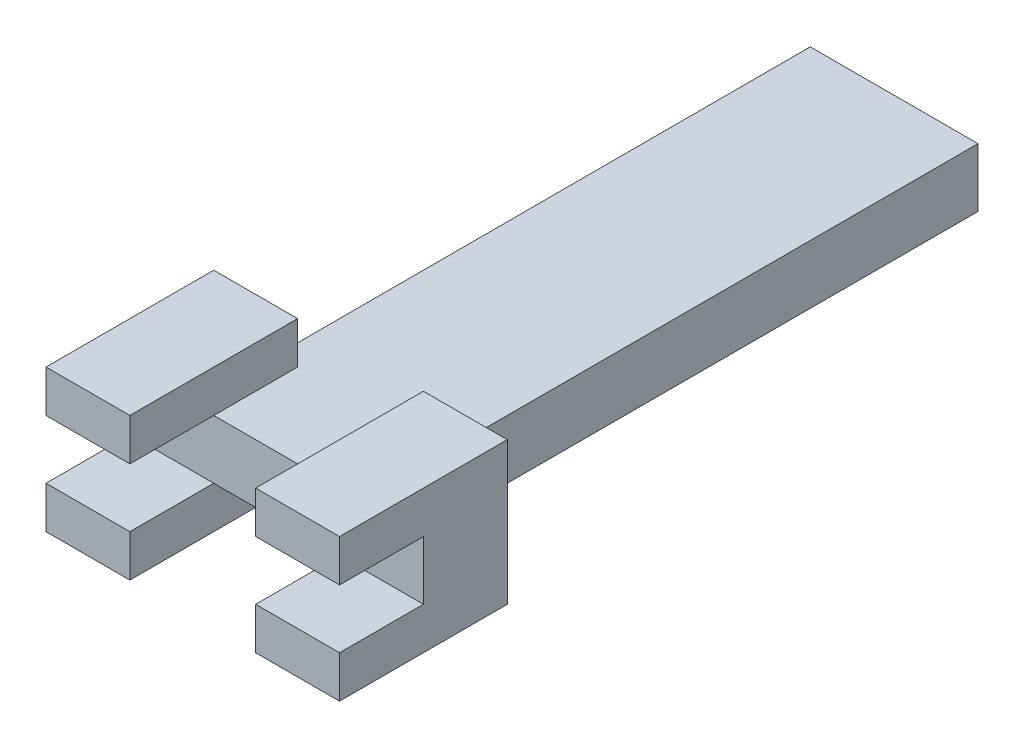
ISO-10303-21;
HEADER;
FILE_DESCRIPTION(('STEP AP214'),'2;1');
FILE_NAME('part.step','',(''),(''),'','','');
FILE_SCHEMA(('AUTOMOTIVE_DESIGN { 1 0 10303 214 1 1 1 1 }'));
ENDSEC;
DATA;
#1=APPLICATION_CONTEXT('core data for automotive mechanical design processes');
#2=APPLICATION_PROTOCOL_DEFINITION('international standard','automotive_design',2000,#1);
#3=PRODUCT_CONTEXT('',#1,'mechanical');
#4=PRODUCT('Part','Part','',(#3));
#5=PRODUCT_RELATED_PRODUCT_CATEGORY('part','',(#4));
#6=PRODUCT_DEFINITION_FORMATION('','',#4);
#7=PRODUCT_DEFINITION_CONTEXT('part definition',#1,'design');
#8=PRODUCT_DEFINITION('design','',#6,#7);
#9=PRODUCT_DEFINITION_SHAPE('','',#8);
#10=(LENGTH_UNIT() NAMED_UNIT(*) SI_UNIT(.MILLI.,.METRE.));
#11=(NAMED_UNIT(*) PLANE_ANGLE_UNIT() SI_UNIT($,.RADIAN.));
#12=(NAMED_UNIT(*) SI_UNIT($,.STERADIAN.) SOLID_ANGLE_UNIT());
#13=UNCERTAINTY_MEASURE_WITH_UNIT(LENGTH_MEASURE(1.E-05),#10,'distance_accuracy_value','');
#14=(GEOMETRIC_REPRESENTATION_CONTEXT(3) GLOBAL_UNCERTAINTY_ASSIGNED_CONTEXT((#13)) GLOBAL_UNIT_ASSIGNED_CONTEXT((#10,
#11,#12)) REPRESENTATION_CONTEXT('',''));
#15=CARTESIAN_POINT('',(0.,0.,0.));
#16=DIRECTION('',(0.,0.,1.));
#17=DIRECTION('',(1.,0.,0.));
#18=AXIS2_PLACEMENT_3D('',#15,#16,#17);
#19=CARTESIAN_POINT('',(0.,0.,0.));
#20=DIRECTION('',(0.,-1.,0.));
#21=DIRECTION('',(0.,0.,-1.));
#22=AXIS2_PLACEMENT_3D('',#19,#20,#21);
#23=PLANE('',#22);
#24=DIRECTION('',(0.,0.,1.));
#25=VECTOR('',#24,1.);
#26=CARTESIAN_POINT('',(17.5,0.,0.));
#27=LINE('',#26,#25);
#28=CARTESIAN_POINT('',(17.5,0.,-10.));
#29=VERTEX_POINT('',#28);
#30=CARTESIAN_POINT('',(17.5,0.,0.));
#31=VERTEX_POINT('',#30);
#32=EDGE_CURVE('E429',#29,#31,#27,.T.);
#33=ORIENTED_EDGE('',*,*,#32,.T.);
#34=DIRECTION('',(1.,0.,0.));
#35=VECTOR('',#34,1.);
#36=CARTESIAN_POINT('',(0.,0.,0.));
#37=LINE('',#36,#35);
#38=CARTESIAN_POINT('',(2.5,0.,0.));
#39=VERTEX_POINT('',#38);
#40=EDGE_CURVE('E356',#39,#31,#37,.T.);
#41=ORIENTED_EDGE('',*,*,#40,.F.);
#42=DIRECTION('',(0.,0.,-1.));
#43=VECTOR('',#42,1.);
#44=CARTESIAN_POINT('',(2.5,0.,0.));
#45=LINE('',#44,#43);
#46=CARTESIAN_POINT('',(2.5,0.,-10.));
#47=VERTEX_POINT('',#46);
#48=EDGE_CURVE('E219',#39,#47,#45,.T.);
#49=ORIENTED_EDGE('',*,*,#48,.T.);
#50=DIRECTION('',(-1.,0.,0.));
#51=VECTOR('',#50,1.);
#52=CARTESIAN_POINT('',(2.5,0.,-10.));
#53=LINE('',#52,#51);
#54=CARTESIAN_POINT('',(0.,0.,-10.));
#55=VERTEX_POINT('',#54);
#56=EDGE_CURVE('E64',#47,#55,#53,.T.);
#57=ORIENTED_EDGE('',*,*,#56,.T.);
#58=DIRECTION('',(0.,0.,1.));
#59=VECTOR('',#58,1.);
#60=CARTESIAN_POINT('',(0.,0.,0.));
#61=LINE('',#60,#59);
#62=CARTESIAN_POINT('',(0.,0.,-73.6254664348473));
#63=VERTEX_POINT('',#62);
#64=EDGE_CURVE('E336',#63,#55,#61,.T.);
#65=ORIENTED_EDGE('',*,*,#64,.F.);
#66=DIRECTION('',(-1.,0.,0.));
#67=VECTOR('',#66,1.);
#68=CARTESIAN_POINT('',(0.,0.,-73.6254664348473));
#69=LINE('',#68,#67);
#70=CARTESIAN_POINT('',(20.,0.,-73.6254664348473));
#71=VERTEX_POINT('',#70);
#72=EDGE_CURVE('E342',#71,#63,#69,.T.);
#73=ORIENTED_EDGE('',*,*,#72,.F.);
#74=DIRECTION('',(0.,0.,-1.));
#75=VECTOR('',#74,1.);
#76=CARTESIAN_POINT('',(20.,0.,0.));
#77=LINE('',#76,#75);
#78=CARTESIAN_POINT('',(20.,0.,-10.));
#79=VERTEX_POINT('',#78);
#80=EDGE_CURVE('E359',#79,#71,#77,.T.);
#81=ORIENTED_EDGE('',*,*,#80,.F.);
#82=DIRECTION('',(-1.,0.,0.));
#83=VECTOR('',#82,1.);
#84=CARTESIAN_POINT('',(17.5,0.,-10.));
#85=LINE('',#84,#83);
#86=EDGE_CURVE('E445',#79,#29,#85,.T.);
#87=ORIENTED_EDGE('',*,*,#86,.T.);
#88=EDGE_LOOP('',(#33,#41,#49,#57,#65,#73,#81,#87));
#89=FACE_BOUND('',#88,.T.);
#90=ADVANCED_FACE('F39',(#89),#23,.T.);
#91=CARTESIAN_POINT('',(20.,7.,0.));
#92=DIRECTION('',(-1.,0.,0.));
#93=DIRECTION('',(0.,0.,1.));
#94=AXIS2_PLACEMENT_3D('',#91,#92,#93);
#95=PLANE('',#94);
#96=DIRECTION('',(0.,1.,0.));
#97=VECTOR('',#96,1.);
#98=CARTESIAN_POINT('',(20.,3.5,-10.));
#99=LINE('',#98,#97);
#100=CARTESIAN_POINT('',(20.,7.,-10.));
#101=VERTEX_POINT('',#100);
#102=EDGE_CURVE('E236',#79,#101,#99,.T.);
#103=ORIENTED_EDGE('',*,*,#102,.F.);
#104=ORIENTED_EDGE('',*,*,#80,.T.);
#105=DIRECTION('',(0.,-1.,0.));
#106=VECTOR('',#105,1.);
#107=CARTESIAN_POINT('',(20.,7.,-73.6254664348473));
#108=LINE('',#107,#106);
#109=CARTESIAN_POINT('',(20.,7.,-73.6254664348473));
#110=VERTEX_POINT('',#109);
#111=EDGE_CURVE('E43',#110,#71,#108,.T.);
#112=ORIENTED_EDGE('',*,*,#111,.F.);
#113=DIRECTION('',(0.,0.,-1.));
#114=VECTOR('',#113,1.);
#115=CARTESIAN_POINT('',(20.,7.,0.));
#116=LINE('',#115,#114);
#117=EDGE_CURVE('E346',#101,#110,#116,.T.);
#118=ORIENTED_EDGE('',*,*,#117,.F.);
#119=EDGE_LOOP('',(#103,#104,#112,#118));
#120=FACE_BOUND('',#119,.T.);
#121=ADVANCED_FACE('F516',(#120),#95,.F.);
#122=CARTESIAN_POINT('',(0.,7.,0.));
#123=DIRECTION('',(0.,-1.,0.));
#124=DIRECTION('',(0.,0.,-1.));
#125=AXIS2_PLACEMENT_3D('',#122,#123,#124);
#126=PLANE('',#125);
#127=DIRECTION('',(1.,0.,0.));
#128=VECTOR('',#127,1.);
#129=CARTESIAN_POINT('',(17.5,7.,0.));
#130=LINE('',#129,#128);
#131=CARTESIAN_POINT('',(17.5,7.,0.));
#132=VERTEX_POINT('',#131);
#133=CARTESIAN_POINT('',(27.5,7.,0.));
#134=VERTEX_POINT('',#133);
#135=EDGE_CURVE('E200',#132,#134,#130,.T.);
#136=ORIENTED_EDGE('',*,*,#135,.T.);
#137=DIRECTION('',(0.,0.,-1.));
#138=VECTOR('',#137,1.);
#139=CARTESIAN_POINT('',(27.5,7.,0.));
#140=LINE('',#139,#138);
#141=CARTESIAN_POINT('',(27.5,7.,10.));
#142=VERTEX_POINT('',#141);
#143=EDGE_CURVE('E296',#142,#134,#140,.T.);
#144=ORIENTED_EDGE('',*,*,#143,.F.);
#145=DIRECTION('',(1.,0.,0.));
#146=VECTOR('',#145,1.);
#147=CARTESIAN_POINT('',(17.5,7.,10.));
#148=LINE('',#147,#146);
#149=CARTESIAN_POINT('',(17.5,7.,10.));
#150=VERTEX_POINT('',#149);
#151=EDGE_CURVE('E245',#150,#142,#148,.T.);
#152=ORIENTED_EDGE('',*,*,#151,.F.);
#153=DIRECTION('',(0.,0.,-1.));
#154=VECTOR('',#153,1.);
#155=CARTESIAN_POINT('',(17.5,7.,10.));
#156=LINE('',#155,#154);
#157=EDGE_CURVE('E257',#150,#132,#156,.T.);
#158=ORIENTED_EDGE('',*,*,#157,.T.);
#159=EDGE_LOOP('',(#136,#144,#152,#158));
#160=FACE_BOUND('',#159,.T.);
#161=ADVANCED_FACE('F514',(#160),#126,.T.);
#162=CARTESIAN_POINT('',(0.,7.,0.));
#163=DIRECTION('',(1.,0.,0.));
#164=DIRECTION('',(0.,0.,-1.));
#165=AXIS2_PLACEMENT_3D('',#162,#163,#164);
#166=PLANE('',#165);
#167=ORIENTED_EDGE('',*,*,#64,.T.);
#168=DIRECTION('',(0.,1.,0.));
#169=VECTOR('',#168,1.);
#170=CARTESIAN_POINT('',(0.,3.5,-9.99999999999999));
#171=LINE('',#170,#169);
#172=CARTESIAN_POINT('',(0.,7.,-9.99999999999999));
#173=VERTEX_POINT('',#172);
#174=EDGE_CURVE('E201',#55,#173,#171,.T.);
#175=ORIENTED_EDGE('',*,*,#174,.T.);
#176=DIRECTION('',(0.,0.,1.));
#177=VECTOR('',#176,1.);
#178=CARTESIAN_POINT('',(0.,7.,0.));
#179=LINE('',#178,#177);
#180=CARTESIAN_POINT('',(0.,7.,-73.6254664348473));
#181=VERTEX_POINT('',#180);
#182=EDGE_CURVE('E337',#181,#173,#179,.T.);
#183=ORIENTED_EDGE('',*,*,#182,.F.);
#184=DIRECTION('',(0.,-1.,0.));
#185=VECTOR('',#184,1.);
#186=CARTESIAN_POINT('',(0.,7.,-73.6254664348473));
#187=LINE('',#186,#185);
#188=EDGE_CURVE('E352',#181,#63,#187,.T.);
#189=ORIENTED_EDGE('',*,*,#188,.T.);
#190=EDGE_LOOP('',(#167,#175,#183,#189));
#191=FACE_BOUND('',#190,.T.);
#192=ADVANCED_FACE('F41',(#191),#166,.F.);
#193=CARTESIAN_POINT('',(0.,7.,0.));
#194=DIRECTION('',(0.,-1.,0.));
#195=DIRECTION('',(0.,0.,-1.));
#196=AXIS2_PLACEMENT_3D('',#193,#194,#195);
#197=PLANE('',#196);
#198=DIRECTION('',(0.,0.,1.));
#199=VECTOR('',#198,1.);
#200=CARTESIAN_POINT('',(-7.5,7.,0.));
#201=LINE('',#200,#199);
#202=CARTESIAN_POINT('',(-7.5,7.,0.));
#203=VERTEX_POINT('',#202);
#204=CARTESIAN_POINT('',(-7.5,7.,10.));
#205=VERTEX_POINT('',#204);
#206=EDGE_CURVE('E324',#203,#205,#201,.T.);
#207=ORIENTED_EDGE('',*,*,#206,.F.);
#208=DIRECTION('',(1.,0.,0.));
#209=VECTOR('',#208,1.);
#210=CARTESIAN_POINT('',(-7.5,7.,0.));
#211=LINE('',#210,#209);
#212=CARTESIAN_POINT('',(2.5,7.,0.));
#213=VERTEX_POINT('',#212);
#214=EDGE_CURVE('E11',#203,#213,#211,.T.);
#215=ORIENTED_EDGE('',*,*,#214,.T.);
#216=DIRECTION('',(0.,0.,-1.));
#217=VECTOR('',#216,1.);
#218=CARTESIAN_POINT('',(2.5,7.,10.));
#219=LINE('',#218,#217);
#220=CARTESIAN_POINT('',(2.5,7.,10.));
#221=VERTEX_POINT('',#220);
#222=EDGE_CURVE('E276',#221,#213,#219,.T.);
#223=ORIENTED_EDGE('',*,*,#222,.F.);
#224=DIRECTION('',(1.,0.,0.));
#225=VECTOR('',#224,1.);
#226=CARTESIAN_POINT('',(-7.5,7.,10.));
#227=LINE('',#226,#225);
#228=EDGE_CURVE('E266',#205,#221,#227,.T.);
#229=ORIENTED_EDGE('',*,*,#228,.F.);
#230=EDGE_LOOP('',(#207,#215,#223,#229));
#231=FACE_BOUND('',#230,.T.);
#232=ADVANCED_FACE('F393',(#231),#197,.T.);
#233=CARTESIAN_POINT('',(0.,7.,0.));
#234=DIRECTION('',(0.,0.,-1.));
#235=DIRECTION('',(-1.,0.,0.));
#236=AXIS2_PLACEMENT_3D('',#233,#234,#235);
#237=PLANE('',#236);
#238=DIRECTION('',(1.,0.,0.));
#239=VECTOR('',#238,1.);
#240=CARTESIAN_POINT('',(17.5,0.,0.));
#241=LINE('',#240,#239);
#242=CARTESIAN_POINT('',(27.5,0.,0.));
#243=VERTEX_POINT('',#242);
#244=EDGE_CURVE('E461',#31,#243,#241,.T.);
#245=ORIENTED_EDGE('',*,*,#244,.T.);
#246=DIRECTION('',(0.,1.,0.));
#247=VECTOR('',#246,1.);
#248=CARTESIAN_POINT('',(27.5,3.5,0.));
#249=LINE('',#248,#247);
#250=EDGE_CURVE('E56',#243,#134,#249,.T.);
#251=ORIENTED_EDGE('',*,*,#250,.T.);
#252=ORIENTED_EDGE('',*,*,#135,.F.);
#253=DIRECTION('',(1.,0.,0.));
#254=VECTOR('',#253,1.);
#255=CARTESIAN_POINT('',(0.,7.,0.));
#256=LINE('',#255,#254);
#257=EDGE_CURVE('E341',#213,#132,#256,.T.);
#258=ORIENTED_EDGE('',*,*,#257,.F.);
#259=ORIENTED_EDGE('',*,*,#214,.F.);
#260=DIRECTION('',(0.,1.,0.));
#261=VECTOR('',#260,1.);
#262=CARTESIAN_POINT('',(-7.5,3.5,0.));
#263=LINE('',#262,#261);
#264=CARTESIAN_POINT('',(-7.5,0.,0.));
#265=VERTEX_POINT('',#264);
#266=EDGE_CURVE('E190',#265,#203,#263,.T.);
#267=ORIENTED_EDGE('',*,*,#266,.F.);
#268=DIRECTION('',(1.,0.,0.));
#269=VECTOR('',#268,1.);
#270=CARTESIAN_POINT('',(-7.5,0.,0.));
#271=LINE('',#270,#269);
#272=EDGE_CURVE('E194',#265,#39,#271,.T.);
#273=ORIENTED_EDGE('',*,*,#272,.T.);
#274=ORIENTED_EDGE('',*,*,#40,.T.);
#275=EDGE_LOOP('',(#245,#251,#252,#258,#259,#267,#273,#274));
#276=FACE_BOUND('',#275,.T.);
#277=ADVANCED_FACE('F192',(#276),#237,.F.);
#278=CARTESIAN_POINT('',(0.,7.,0.));
#279=DIRECTION('',(0.,-1.,0.));
#280=DIRECTION('',(0.,0.,-1.));
#281=AXIS2_PLACEMENT_3D('',#278,#279,#280);
#282=PLANE('',#281);
#283=DIRECTION('',(0.,0.,1.));
#284=VECTOR('',#283,1.);
#285=CARTESIAN_POINT('',(17.5,7.,0.));
#286=LINE('',#285,#284);
#287=CARTESIAN_POINT('',(17.5,7.,-10.));
#288=VERTEX_POINT('',#287);
#289=EDGE_CURVE('E281',#288,#132,#286,.T.);
#290=ORIENTED_EDGE('',*,*,#289,.F.);
#291=DIRECTION('',(-1.,0.,0.));
#292=VECTOR('',#291,1.);
#293=CARTESIAN_POINT('',(17.5,7.,-10.));
#294=LINE('',#293,#292);
#295=EDGE_CURVE('E286',#101,#288,#294,.T.);
#296=ORIENTED_EDGE('',*,*,#295,.F.);
#297=ORIENTED_EDGE('',*,*,#117,.T.);
#298=DIRECTION('',(-1.,0.,0.));
#299=VECTOR('',#298,1.);
#300=CARTESIAN_POINT('',(0.,7.,-73.6254664348473));
#301=LINE('',#300,#299);
#302=EDGE_CURVE('E349',#110,#181,#301,.T.);
#303=ORIENTED_EDGE('',*,*,#302,.T.);
#304=ORIENTED_EDGE('',*,*,#182,.T.);
#305=DIRECTION('',(-1.,0.,0.));
#306=VECTOR('',#305,1.);
#307=CARTESIAN_POINT('',(2.5,7.,-10.));
#308=LINE('',#307,#306);
#309=CARTESIAN_POINT('',(2.5,7.,-10.));
#310=VERTEX_POINT('',#309);
#311=EDGE_CURVE('E308',#310,#173,#308,.T.);
#312=ORIENTED_EDGE('',*,*,#311,.F.);
#313=DIRECTION('',(0.,0.,-1.));
#314=VECTOR('',#313,1.);
#315=CARTESIAN_POINT('',(2.5,7.,0.));
#316=LINE('',#315,#314);
#317=EDGE_CURVE('E314',#213,#310,#316,.T.);
#318=ORIENTED_EDGE('',*,*,#317,.F.);
#319=ORIENTED_EDGE('',*,*,#257,.T.);
#320=EDGE_LOOP('',(#290,#296,#297,#303,#304,#312,#318,#319));
#321=FACE_BOUND('',#320,.T.);
#322=ADVANCED_FACE('F382',(#321),#282,.F.);
#323=CARTESIAN_POINT('',(0.,7.,-73.6254664348473));
#324=DIRECTION('',(0.,0.,1.));
#325=DIRECTION('',(1.,0.,0.));
#326=AXIS2_PLACEMENT_3D('',#323,#324,#325);
#327=PLANE('',#326);
#328=ORIENTED_EDGE('',*,*,#72,.T.);
#329=ORIENTED_EDGE('',*,*,#188,.F.);
#330=ORIENTED_EDGE('',*,*,#302,.F.);
#331=ORIENTED_EDGE('',*,*,#111,.T.);
#332=EDGE_LOOP('',(#328,#329,#330,#331));
#333=FACE_BOUND('',#332,.T.);
#334=ADVANCED_FACE('F375',(#333),#327,.F.);
#335=CARTESIAN_POINT('',(2.5,12.,-10.));
#336=DIRECTION('',(0.,0.,1.));
#337=DIRECTION('',(1.,0.,0.));
#338=AXIS2_PLACEMENT_3D('',#335,#336,#337);
#339=PLANE('',#338);
#340=ORIENTED_EDGE('',*,*,#311,.T.);
#341=ORIENTED_EDGE('',*,*,#174,.F.);
#342=ORIENTED_EDGE('',*,*,#56,.F.);
#343=DIRECTION('',(0.,1.,0.));
#344=VECTOR('',#343,1.);
#345=CARTESIAN_POINT('',(2.5,-5.,-10.));
#346=LINE('',#345,#344);
#347=CARTESIAN_POINT('',(2.5,-5.,-10.));
#348=VERTEX_POINT('',#347);
#349=EDGE_CURVE('E230',#348,#47,#346,.T.);
#350=ORIENTED_EDGE('',*,*,#349,.F.);
#351=DIRECTION('',(-1.,0.,0.));
#352=VECTOR('',#351,1.);
#353=CARTESIAN_POINT('',(2.5,-5.,-10.));
#354=LINE('',#353,#352);
#355=CARTESIAN_POINT('',(-7.5,-5.,-9.99999999999999));
#356=VERTEX_POINT('',#355);
#357=EDGE_CURVE('E218',#348,#356,#354,.T.);
#358=ORIENTED_EDGE('',*,*,#357,.T.);
#359=DIRECTION('',(0.,-1.,0.));
#360=VECTOR('',#359,1.);
#361=CARTESIAN_POINT('',(-7.5,12.,-9.99999999999999));
#362=LINE('',#361,#360);
#363=CARTESIAN_POINT('',(-7.5,12.,-9.99999999999999));
#364=VERTEX_POINT('',#363);
#365=EDGE_CURVE('E333',#364,#356,#362,.T.);
#366=ORIENTED_EDGE('',*,*,#365,.F.);
#367=DIRECTION('',(-1.,0.,0.));
#368=VECTOR('',#367,1.);
#369=CARTESIAN_POINT('',(2.5,12.,-10.));
#370=LINE('',#369,#368);
#371=CARTESIAN_POINT('',(2.5,12.,-10.));
#372=VERTEX_POINT('',#371);
#373=EDGE_CURVE('E309',#372,#364,#370,.T.);
#374=ORIENTED_EDGE('',*,*,#373,.F.);
#375=DIRECTION('',(0.,-1.,0.));
#376=VECTOR('',#375,1.);
#377=CARTESIAN_POINT('',(2.5,12.,-10.));
#378=LINE('',#377,#376);
#379=EDGE_CURVE('E320',#372,#310,#378,.T.);
#380=ORIENTED_EDGE('',*,*,#379,.T.);
#381=EDGE_LOOP('',(#340,#341,#342,#350,#358,#366,#374,#380));
#382=FACE_BOUND('',#381,.T.);
#383=ADVANCED_FACE('F384',(#382),#339,.F.);
#384=CARTESIAN_POINT('',(-7.5,12.,0.));
#385=DIRECTION('',(1.,0.,0.));
#386=DIRECTION('',(0.,0.,-1.));
#387=AXIS2_PLACEMENT_3D('',#384,#385,#386);
#388=PLANE('',#387);
#389=ORIENTED_EDGE('',*,*,#365,.T.);
#390=DIRECTION('',(0.,0.,1.));
#391=VECTOR('',#390,1.);
#392=CARTESIAN_POINT('',(-7.5,-5.,0.));
#393=LINE('',#392,#391);
#394=CARTESIAN_POINT('',(-7.5,-5.,10.));
#395=VERTEX_POINT('',#394);
#396=EDGE_CURVE('E233',#356,#395,#393,.T.);
#397=ORIENTED_EDGE('',*,*,#396,.T.);
#398=DIRECTION('',(0.,1.,0.));
#399=VECTOR('',#398,1.);
#400=CARTESIAN_POINT('',(-7.5,-5.,10.));
#401=LINE('',#400,#399);
#402=CARTESIAN_POINT('',(-7.5,0.,10.));
#403=VERTEX_POINT('',#402);
#404=EDGE_CURVE('E211',#395,#403,#401,.T.);
#405=ORIENTED_EDGE('',*,*,#404,.T.);
#406=DIRECTION('',(0.,0.,1.));
#407=VECTOR('',#406,1.);
#408=CARTESIAN_POINT('',(-7.5,0.,0.));
#409=LINE('',#408,#407);
#410=EDGE_CURVE('E207',#265,#403,#409,.T.);
#411=ORIENTED_EDGE('',*,*,#410,.F.);
#412=ORIENTED_EDGE('',*,*,#266,.T.);
#413=ORIENTED_EDGE('',*,*,#206,.T.);
#414=DIRECTION('',(0.,-1.,0.));
#415=VECTOR('',#414,1.);
#416=CARTESIAN_POINT('',(-7.5,12.,10.));
#417=LINE('',#416,#415);
#418=CARTESIAN_POINT('',(-7.5,12.,10.));
#419=VERTEX_POINT('',#418);
#420=EDGE_CURVE('E262',#419,#205,#417,.T.);
#421=ORIENTED_EDGE('',*,*,#420,.F.);
#422=DIRECTION('',(0.,0.,1.));
#423=VECTOR('',#422,1.);
#424=CARTESIAN_POINT('',(-7.5,12.,0.));
#425=LINE('',#424,#423);
#426=EDGE_CURVE('E313',#364,#419,#425,.T.);
#427=ORIENTED_EDGE('',*,*,#426,.F.);
#428=EDGE_LOOP('',(#389,#397,#405,#411,#412,#413,#421,#427));
#429=FACE_BOUND('',#428,.T.);
#430=ADVANCED_FACE('F214',(#429),#388,.F.);
#431=CARTESIAN_POINT('',(2.5,12.,0.));
#432=DIRECTION('',(-1.,0.,0.));
#433=DIRECTION('',(0.,0.,1.));
#434=AXIS2_PLACEMENT_3D('',#431,#432,#433);
#435=PLANE('',#434);
#436=ORIENTED_EDGE('',*,*,#317,.T.);
#437=ORIENTED_EDGE('',*,*,#379,.F.);
#438=DIRECTION('',(0.,0.,-1.));
#439=VECTOR('',#438,1.);
#440=CARTESIAN_POINT('',(2.5,12.,0.));
#441=LINE('',#440,#439);
#442=CARTESIAN_POINT('',(2.5,12.,10.));
#443=VERTEX_POINT('',#442);
#444=EDGE_CURVE('E317',#443,#372,#441,.T.);
#445=ORIENTED_EDGE('',*,*,#444,.F.);
#446=DIRECTION('',(0.,1.,0.));
#447=VECTOR('',#446,1.);
#448=CARTESIAN_POINT('',(2.5,12.,10.));
#449=LINE('',#448,#447);
#450=EDGE_CURVE('E269',#221,#443,#449,.T.);
#451=ORIENTED_EDGE('',*,*,#450,.F.);
#452=ORIENTED_EDGE('',*,*,#222,.T.);
#453=EDGE_LOOP('',(#436,#437,#445,#451,#452));
#454=FACE_BOUND('',#453,.T.);
#455=ADVANCED_FACE('F389',(#454),#435,.F.);
#456=CARTESIAN_POINT('',(0.,12.,0.));
#457=DIRECTION('',(0.,-1.,0.));
#458=DIRECTION('',(0.,0.,-1.));
#459=AXIS2_PLACEMENT_3D('',#456,#457,#458);
#460=PLANE('',#459);
#461=ORIENTED_EDGE('',*,*,#373,.T.);
#462=ORIENTED_EDGE('',*,*,#426,.T.);
#463=DIRECTION('',(-1.,0.,0.));
#464=VECTOR('',#463,1.);
#465=CARTESIAN_POINT('',(-7.5,12.,10.));
#466=LINE('',#465,#464);
#467=EDGE_CURVE('E273',#443,#419,#466,.T.);
#468=ORIENTED_EDGE('',*,*,#467,.F.);
#469=ORIENTED_EDGE('',*,*,#444,.T.);
#470=EDGE_LOOP('',(#461,#462,#468,#469));
#471=FACE_BOUND('',#470,.T.);
#472=ADVANCED_FACE('F400',(#471),#460,.F.);
#473=CARTESIAN_POINT('',(17.5,12.,0.));
#474=DIRECTION('',(1.,0.,0.));
#475=DIRECTION('',(0.,0.,-1.));
#476=AXIS2_PLACEMENT_3D('',#473,#474,#475);
#477=PLANE('',#476);
#478=ORIENTED_EDGE('',*,*,#289,.T.);
#479=ORIENTED_EDGE('',*,*,#157,.F.);
#480=DIRECTION('',(0.,-1.,0.));
#481=VECTOR('',#480,1.);
#482=CARTESIAN_POINT('',(17.5,12.,10.));
#483=LINE('',#482,#481);
#484=CARTESIAN_POINT('',(17.5,12.,10.));
#485=VERTEX_POINT('',#484);
#486=EDGE_CURVE('E241',#485,#150,#483,.T.);
#487=ORIENTED_EDGE('',*,*,#486,.F.);
#488=DIRECTION('',(0.,0.,1.));
#489=VECTOR('',#488,1.);
#490=CARTESIAN_POINT('',(17.5,12.,0.));
#491=LINE('',#490,#489);
#492=CARTESIAN_POINT('',(17.5,12.,-10.));
#493=VERTEX_POINT('',#492);
#494=EDGE_CURVE('E282',#493,#485,#491,.T.);
#495=ORIENTED_EDGE('',*,*,#494,.F.);
#496=DIRECTION('',(0.,-1.,0.));
#497=VECTOR('',#496,1.);
#498=CARTESIAN_POINT('',(17.5,12.,-10.));
#499=LINE('',#498,#497);
#500=EDGE_CURVE('E292',#493,#288,#499,.T.);
#501=ORIENTED_EDGE('',*,*,#500,.T.);
#502=EDGE_LOOP('',(#478,#479,#487,#495,#501));
#503=FACE_BOUND('',#502,.T.);
#504=ADVANCED_FACE('F511',(#503),#477,.F.);
#505=CARTESIAN_POINT('',(27.5,12.,0.));
#506=DIRECTION('',(-1.,0.,0.));
#507=DIRECTION('',(0.,0.,1.));
#508=AXIS2_PLACEMENT_3D('',#505,#506,#507);
#509=PLANE('',#508);
#510=ORIENTED_EDGE('',*,*,#143,.T.);
#511=ORIENTED_EDGE('',*,*,#250,.F.);
#512=DIRECTION('',(0.,0.,-1.));
#513=VECTOR('',#512,1.);
#514=CARTESIAN_POINT('',(27.5,0.,0.));
#515=LINE('',#514,#513);
#516=CARTESIAN_POINT('',(27.5,0.,10.));
#517=VERTEX_POINT('',#516);
#518=EDGE_CURVE('E434',#517,#243,#515,.T.);
#519=ORIENTED_EDGE('',*,*,#518,.F.);
#520=DIRECTION('',(0.,-1.,0.));
#521=VECTOR('',#520,1.);
#522=CARTESIAN_POINT('',(27.5,-5.,10.));
#523=LINE('',#522,#521);
#524=CARTESIAN_POINT('',(27.5,-5.,10.));
#525=VERTEX_POINT('',#524);
#526=EDGE_CURVE('E481',#517,#525,#523,.T.);
#527=ORIENTED_EDGE('',*,*,#526,.T.);
#528=DIRECTION('',(0.,0.,-1.));
#529=VECTOR('',#528,1.);
#530=CARTESIAN_POINT('',(27.5,-5.,0.));
#531=LINE('',#530,#529);
#532=CARTESIAN_POINT('',(27.5,-5.,-10.));
#533=VERTEX_POINT('',#532);
#534=EDGE_CURVE('E438',#525,#533,#531,.T.);
#535=ORIENTED_EDGE('',*,*,#534,.T.);
#536=DIRECTION('',(0.,-1.,0.));
#537=VECTOR('',#536,1.);
#538=CARTESIAN_POINT('',(27.5,12.,-10.));
#539=LINE('',#538,#537);
#540=CARTESIAN_POINT('',(27.5,12.,-10.));
#541=VERTEX_POINT('',#540);
#542=EDGE_CURVE('E305',#541,#533,#539,.T.);
#543=ORIENTED_EDGE('',*,*,#542,.F.);
#544=DIRECTION('',(0.,0.,-1.));
#545=VECTOR('',#544,1.);
#546=CARTESIAN_POINT('',(27.5,12.,0.));
#547=LINE('',#546,#545);
#548=CARTESIAN_POINT('',(27.5,12.,10.));
#549=VERTEX_POINT('',#548);
#550=EDGE_CURVE('E285',#549,#541,#547,.T.);
#551=ORIENTED_EDGE('',*,*,#550,.F.);
#552=DIRECTION('',(0.,1.,0.));
#553=VECTOR('',#552,1.);
#554=CARTESIAN_POINT('',(27.5,12.,10.));
#555=LINE('',#554,#553);
#556=EDGE_CURVE('E249',#142,#549,#555,.T.);
#557=ORIENTED_EDGE('',*,*,#556,.F.);
#558=EDGE_LOOP('',(#510,#511,#519,#527,#535,#543,#551,#557));
#559=FACE_BOUND('',#558,.T.);
#560=ADVANCED_FACE('F495',(#559),#509,.F.);
#561=CARTESIAN_POINT('',(17.5,12.,-10.));
#562=DIRECTION('',(0.,0.,1.));
#563=DIRECTION('',(1.,0.,0.));
#564=AXIS2_PLACEMENT_3D('',#561,#562,#563);
#565=PLANE('',#564);
#566=ORIENTED_EDGE('',*,*,#542,.T.);
#567=DIRECTION('',(-1.,0.,0.));
#568=VECTOR('',#567,1.);
#569=CARTESIAN_POINT('',(17.5,-5.,-10.));
#570=LINE('',#569,#568);
#571=CARTESIAN_POINT('',(17.5,-5.,-10.));
#572=VERTEX_POINT('',#571);
#573=EDGE_CURVE('E433',#533,#572,#570,.T.);
#574=ORIENTED_EDGE('',*,*,#573,.T.);
#575=DIRECTION('',(0.,1.,0.));
#576=VECTOR('',#575,1.);
#577=CARTESIAN_POINT('',(17.5,-5.,-10.));
#578=LINE('',#577,#576);
#579=EDGE_CURVE('E442',#572,#29,#578,.T.);
#580=ORIENTED_EDGE('',*,*,#579,.T.);
#581=ORIENTED_EDGE('',*,*,#86,.F.);
#582=ORIENTED_EDGE('',*,*,#102,.T.);
#583=ORIENTED_EDGE('',*,*,#295,.T.);
#584=ORIENTED_EDGE('',*,*,#500,.F.);
#585=DIRECTION('',(-1.,0.,0.));
#586=VECTOR('',#585,1.);
#587=CARTESIAN_POINT('',(17.5,12.,-10.));
#588=LINE('',#587,#586);
#589=EDGE_CURVE('E289',#541,#493,#588,.T.);
#590=ORIENTED_EDGE('',*,*,#589,.F.);
#591=EDGE_LOOP('',(#566,#574,#580,#581,#582,#583,#584,#590));
#592=FACE_BOUND('',#591,.T.);
#593=ADVANCED_FACE('F501',(#592),#565,.F.);
#594=CARTESIAN_POINT('',(0.,12.,0.));
#595=DIRECTION('',(0.,-1.,0.));
#596=DIRECTION('',(0.,0.,-1.));
#597=AXIS2_PLACEMENT_3D('',#594,#595,#596);
#598=PLANE('',#597);
#599=ORIENTED_EDGE('',*,*,#494,.T.);
#600=DIRECTION('',(-1.,0.,0.));
#601=VECTOR('',#600,1.);
#602=CARTESIAN_POINT('',(17.5,12.,10.));
#603=LINE('',#602,#601);
#604=EDGE_CURVE('E253',#549,#485,#603,.T.);
#605=ORIENTED_EDGE('',*,*,#604,.F.);
#606=ORIENTED_EDGE('',*,*,#550,.T.);
#607=ORIENTED_EDGE('',*,*,#589,.T.);
#608=EDGE_LOOP('',(#599,#605,#606,#607));
#609=FACE_BOUND('',#608,.T.);
#610=ADVANCED_FACE('F504',(#609),#598,.F.);
#611=CARTESIAN_POINT('',(0.,0.,10.));
#612=DIRECTION('',(0.,0.,1.));
#613=DIRECTION('',(1.,0.,0.));
#614=AXIS2_PLACEMENT_3D('',#611,#612,#613);
#615=PLANE('',#614);
#616=ORIENTED_EDGE('',*,*,#420,.T.);
#617=ORIENTED_EDGE('',*,*,#228,.T.);
#618=ORIENTED_EDGE('',*,*,#450,.T.);
#619=ORIENTED_EDGE('',*,*,#467,.T.);
#620=EDGE_LOOP('',(#616,#617,#618,#619));
#621=FACE_BOUND('',#620,.T.);
#622=ADVANCED_FACE('F397',(#621),#615,.T.);
#623=CARTESIAN_POINT('',(0.,0.,10.));
#624=DIRECTION('',(0.,0.,1.));
#625=DIRECTION('',(1.,0.,0.));
#626=AXIS2_PLACEMENT_3D('',#623,#624,#625);
#627=PLANE('',#626);
#628=ORIENTED_EDGE('',*,*,#486,.T.);
#629=ORIENTED_EDGE('',*,*,#151,.T.);
#630=ORIENTED_EDGE('',*,*,#556,.T.);
#631=ORIENTED_EDGE('',*,*,#604,.T.);
#632=EDGE_LOOP('',(#628,#629,#630,#631));
#633=FACE_BOUND('',#632,.T.);
#634=ADVANCED_FACE('F508',(#633),#627,.T.);
#635=CARTESIAN_POINT('',(0.,0.,0.));
#636=DIRECTION('',(0.,1.,0.));
#637=DIRECTION('',(0.,0.,-1.));
#638=AXIS2_PLACEMENT_3D('',#635,#636,#637);
#639=PLANE('',#638);
#640=ORIENTED_EDGE('',*,*,#272,.F.);
#641=ORIENTED_EDGE('',*,*,#410,.T.);
#642=DIRECTION('',(1.,0.,0.));
#643=VECTOR('',#642,1.);
#644=CARTESIAN_POINT('',(-7.5,0.,10.));
#645=LINE('',#644,#643);
#646=CARTESIAN_POINT('',(2.5,0.,10.));
#647=VERTEX_POINT('',#646);
#648=EDGE_CURVE('E413',#403,#647,#645,.T.);
#649=ORIENTED_EDGE('',*,*,#648,.T.);
#650=DIRECTION('',(0.,0.,-1.));
#651=VECTOR('',#650,1.);
#652=CARTESIAN_POINT('',(2.5,0.,10.));
#653=LINE('',#652,#651);
#654=EDGE_CURVE('E209',#647,#39,#653,.T.);
#655=ORIENTED_EDGE('',*,*,#654,.T.);
#656=EDGE_LOOP('',(#640,#641,#649,#655));
#657=FACE_BOUND('',#656,.T.);
#658=ADVANCED_FACE('F205',(#657),#639,.T.);
#659=CARTESIAN_POINT('',(2.5,-5.,0.));
#660=DIRECTION('',(1.,0.,0.));
#661=DIRECTION('',(0.,0.,-1.));
#662=AXIS2_PLACEMENT_3D('',#659,#660,#661);
#663=PLANE('',#662);
#664=ORIENTED_EDGE('',*,*,#48,.F.);
#665=ORIENTED_EDGE('',*,*,#654,.F.);
#666=DIRECTION('',(0.,-1.,0.));
#667=VECTOR('',#666,1.);
#668=CARTESIAN_POINT('',(2.5,-5.,10.));
#669=LINE('',#668,#667);
#670=CARTESIAN_POINT('',(2.5,-5.,10.));
#671=VERTEX_POINT('',#670);
#672=EDGE_CURVE('E419',#647,#671,#669,.T.);
#673=ORIENTED_EDGE('',*,*,#672,.T.);
#674=DIRECTION('',(0.,0.,-1.));
#675=VECTOR('',#674,1.);
#676=CARTESIAN_POINT('',(2.5,-5.,0.));
#677=LINE('',#676,#675);
#678=EDGE_CURVE('E224',#671,#348,#677,.T.);
#679=ORIENTED_EDGE('',*,*,#678,.T.);
#680=ORIENTED_EDGE('',*,*,#349,.T.);
#681=EDGE_LOOP('',(#664,#665,#673,#679,#680));
#682=FACE_BOUND('',#681,.T.);
#683=ADVANCED_FACE('F456',(#682),#663,.T.);
#684=CARTESIAN_POINT('',(0.,-5.,0.));
#685=DIRECTION('',(0.,1.,0.));
#686=DIRECTION('',(0.,0.,-1.));
#687=AXIS2_PLACEMENT_3D('',#684,#685,#686);
#688=PLANE('',#687);
#689=ORIENTED_EDGE('',*,*,#357,.F.);
#690=ORIENTED_EDGE('',*,*,#678,.F.);
#691=DIRECTION('',(-1.,0.,0.));
#692=VECTOR('',#691,1.);
#693=CARTESIAN_POINT('',(-7.5,-5.,10.));
#694=LINE('',#693,#692);
#695=EDGE_CURVE('E411',#671,#395,#694,.T.);
#696=ORIENTED_EDGE('',*,*,#695,.T.);
#697=ORIENTED_EDGE('',*,*,#396,.F.);
#698=EDGE_LOOP('',(#689,#690,#696,#697));
#699=FACE_BOUND('',#698,.T.);
#700=ADVANCED_FACE('F416',(#699),#688,.F.);
#701=CARTESIAN_POINT('',(0.,0.,0.));
#702=DIRECTION('',(0.,1.,0.));
#703=DIRECTION('',(0.,0.,-1.));
#704=AXIS2_PLACEMENT_3D('',#701,#702,#703);
#705=PLANE('',#704);
#706=ORIENTED_EDGE('',*,*,#518,.T.);
#707=ORIENTED_EDGE('',*,*,#244,.F.);
#708=DIRECTION('',(0.,0.,-1.));
#709=VECTOR('',#708,1.);
#710=CARTESIAN_POINT('',(17.5,0.,10.));
#711=LINE('',#710,#709);
#712=CARTESIAN_POINT('',(17.5,0.,10.));
#713=VERTEX_POINT('',#712);
#714=EDGE_CURVE('E212',#713,#31,#711,.T.);
#715=ORIENTED_EDGE('',*,*,#714,.F.);
#716=DIRECTION('',(1.,0.,0.));
#717=VECTOR('',#716,1.);
#718=CARTESIAN_POINT('',(17.5,0.,10.));
#719=LINE('',#718,#717);
#720=EDGE_CURVE('E471',#713,#517,#719,.T.);
#721=ORIENTED_EDGE('',*,*,#720,.T.);
#722=EDGE_LOOP('',(#706,#707,#715,#721));
#723=FACE_BOUND('',#722,.T.);
#724=ADVANCED_FACE('F472',(#723),#705,.T.);
#725=CARTESIAN_POINT('',(17.5,-5.,0.));
#726=DIRECTION('',(-1.,0.,0.));
#727=DIRECTION('',(0.,0.,1.));
#728=AXIS2_PLACEMENT_3D('',#725,#726,#727);
#729=PLANE('',#728);
#730=ORIENTED_EDGE('',*,*,#32,.F.);
#731=ORIENTED_EDGE('',*,*,#579,.F.);
#732=DIRECTION('',(0.,0.,1.));
#733=VECTOR('',#732,1.);
#734=CARTESIAN_POINT('',(17.5,-5.,0.));
#735=LINE('',#734,#733);
#736=CARTESIAN_POINT('',(17.5,-5.,10.));
#737=VERTEX_POINT('',#736);
#738=EDGE_CURVE('E430',#572,#737,#735,.T.);
#739=ORIENTED_EDGE('',*,*,#738,.T.);
#740=DIRECTION('',(0.,1.,0.));
#741=VECTOR('',#740,1.);
#742=CARTESIAN_POINT('',(17.5,-5.,10.));
#743=LINE('',#742,#741);
#744=EDGE_CURVE('E466',#737,#713,#743,.T.);
#745=ORIENTED_EDGE('',*,*,#744,.T.);
#746=ORIENTED_EDGE('',*,*,#714,.T.);
#747=EDGE_LOOP('',(#730,#731,#739,#745,#746));
#748=FACE_BOUND('',#747,.T.);
#749=ADVANCED_FACE('F464',(#748),#729,.T.);
#750=CARTESIAN_POINT('',(0.,-5.,0.));
#751=DIRECTION('',(0.,1.,0.));
#752=DIRECTION('',(0.,0.,-1.));
#753=AXIS2_PLACEMENT_3D('',#750,#751,#752);
#754=PLANE('',#753);
#755=ORIENTED_EDGE('',*,*,#738,.F.);
#756=ORIENTED_EDGE('',*,*,#573,.F.);
#757=ORIENTED_EDGE('',*,*,#534,.F.);
#758=DIRECTION('',(-1.,0.,0.));
#759=VECTOR('',#758,1.);
#760=CARTESIAN_POINT('',(17.5,-5.,10.));
#761=LINE('',#760,#759);
#762=EDGE_CURVE('E476',#525,#737,#761,.T.);
#763=ORIENTED_EDGE('',*,*,#762,.T.);
#764=EDGE_LOOP('',(#755,#756,#757,#763));
#765=FACE_BOUND('',#764,.T.);
#766=ADVANCED_FACE('F490',(#765),#754,.F.);
#767=CARTESIAN_POINT('',(0.,7.,10.));
#768=DIRECTION('',(0.,0.,1.));
#769=DIRECTION('',(1.,0.,0.));
#770=AXIS2_PLACEMENT_3D('',#767,#768,#769);
#771=PLANE('',#770);
#772=ORIENTED_EDGE('',*,*,#404,.F.);
#773=ORIENTED_EDGE('',*,*,#695,.F.);
#774=ORIENTED_EDGE('',*,*,#672,.F.);
#775=ORIENTED_EDGE('',*,*,#648,.F.);
#776=EDGE_LOOP('',(#772,#773,#774,#775));
#777=FACE_BOUND('',#776,.T.);
#778=ADVANCED_FACE('F409',(#777),#771,.T.);
#779=CARTESIAN_POINT('',(0.,7.,10.));
#780=DIRECTION('',(0.,0.,1.));
#781=DIRECTION('',(1.,0.,0.));
#782=AXIS2_PLACEMENT_3D('',#779,#780,#781);
#783=PLANE('',#782);
#784=ORIENTED_EDGE('',*,*,#744,.F.);
#785=ORIENTED_EDGE('',*,*,#762,.F.);
#786=ORIENTED_EDGE('',*,*,#526,.F.);
#787=ORIENTED_EDGE('',*,*,#720,.F.);
#788=EDGE_LOOP('',(#784,#785,#786,#787));
#789=FACE_BOUND('',#788,.T.);
#790=ADVANCED_FACE('F494',(#789),#783,.T.);
#791=CLOSED_SHELL('',(#90,#121,#161,#192,#232,#277,#322,#334,#383,#430,#455,#472,#504,#560,#593,
#610,#622,#634,#658,#683,#700,#724,#749,#766,#778,#790));
#792=MANIFOLD_SOLID_BREP('B2',#791);
#793=ADVANCED_BREP_SHAPE_REPRESENTATION('',(#18,#792),#14);
#794=SHAPE_DEFINITION_REPRESENTATION(#9,#793);
ENDSEC;
END-ISO-10303-21;
